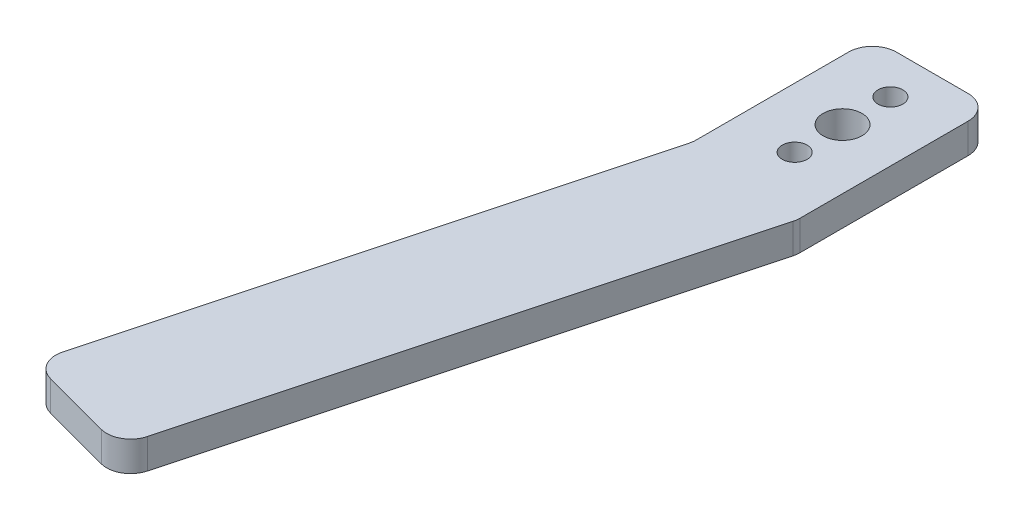
ISO-10303-21;
HEADER;
FILE_DESCRIPTION(('STEP AP214'),'2;1');
FILE_NAME('part.step','',(''),(''),'','','');
FILE_SCHEMA(('AUTOMOTIVE_DESIGN { 1 0 10303 214 1 1 1 1 }'));
ENDSEC;
DATA;
#1=APPLICATION_CONTEXT('core data for automotive mechanical design processes');
#2=APPLICATION_PROTOCOL_DEFINITION('international standard','automotive_design',2000,#1);
#3=PRODUCT_CONTEXT('',#1,'mechanical');
#4=PRODUCT('Part','Part','',(#3));
#5=PRODUCT_RELATED_PRODUCT_CATEGORY('part','',(#4));
#6=PRODUCT_DEFINITION_FORMATION('','',#4);
#7=PRODUCT_DEFINITION_CONTEXT('part definition',#1,'design');
#8=PRODUCT_DEFINITION('design','',#6,#7);
#9=PRODUCT_DEFINITION_SHAPE('','',#8);
#10=(LENGTH_UNIT() NAMED_UNIT(*) SI_UNIT(.MILLI.,.METRE.));
#11=(NAMED_UNIT(*) PLANE_ANGLE_UNIT() SI_UNIT($,.RADIAN.));
#12=(NAMED_UNIT(*) SI_UNIT($,.STERADIAN.) SOLID_ANGLE_UNIT());
#13=UNCERTAINTY_MEASURE_WITH_UNIT(LENGTH_MEASURE(1.E-05),#10,'distance_accuracy_value','');
#14=(GEOMETRIC_REPRESENTATION_CONTEXT(3) GLOBAL_UNCERTAINTY_ASSIGNED_CONTEXT((#13)) GLOBAL_UNIT_ASSIGNED_CONTEXT((#10,
#11,#12)) REPRESENTATION_CONTEXT('',''));
#15=CARTESIAN_POINT('',(0.,0.,0.));
#16=DIRECTION('',(0.,0.,1.));
#17=DIRECTION('',(1.,0.,0.));
#18=AXIS2_PLACEMENT_3D('',#15,#16,#17);
#19=CARTESIAN_POINT('',(0.,5.,0.));
#20=DIRECTION('',(0.,1.,0.));
#21=DIRECTION('',(0.,0.,1.));
#22=AXIS2_PLACEMENT_3D('',#19,#20,#21);
#23=PLANE('',#22);
#24=CARTESIAN_POINT('',(-49.15,5.,8.));
#25=DIRECTION('',(0.,1.,0.));
#26=DIRECTION('',(0.,0.,1.));
#27=AXIS2_PLACEMENT_3D('',#24,#25,#26);
#28=CIRCLE('',#27,2.075);
#29=CARTESIAN_POINT('',(-49.15,5.,10.075));
#30=VERTEX_POINT('',#29);
#31=EDGE_CURVE('E255',#30,#30,#28,.F.);
#32=ORIENTED_EDGE('',*,*,#31,.T.);
#33=EDGE_LOOP('',(#32));
#34=FACE_BOUND('',#33,.T.);
#35=CARTESIAN_POINT('',(-49.15,5.,-8.));
#36=DIRECTION('',(0.,1.,0.));
#37=DIRECTION('',(0.,0.,1.));
#38=AXIS2_PLACEMENT_3D('',#35,#36,#37);
#39=CIRCLE('',#38,2.075);
#40=CARTESIAN_POINT('',(-49.15,5.,-5.925));
#41=VERTEX_POINT('',#40);
#42=EDGE_CURVE('E247',#41,#41,#39,.T.);
#43=ORIENTED_EDGE('',*,*,#42,.F.);
#44=EDGE_LOOP('',(#43));
#45=FACE_BOUND('',#44,.T.);
#46=DIRECTION('',(-1.,0.,0.));
#47=VECTOR('',#46,1.);
#48=CARTESIAN_POINT('',(-59.15,5.,-15.));
#49=LINE('',#48,#47);
#50=CARTESIAN_POINT('',(-43.15,5.,-15.));
#51=VERTEX_POINT('',#50);
#52=CARTESIAN_POINT('',(-55.15,5.,-15.));
#53=VERTEX_POINT('',#52);
#54=EDGE_CURVE('E236',#51,#53,#49,.T.);
#55=ORIENTED_EDGE('',*,*,#54,.T.);
#56=CARTESIAN_POINT('',(-55.15,5.,-11.));
#57=DIRECTION('',(0.,1.,0.));
#58=DIRECTION('',(0.,0.,1.));
#59=AXIS2_PLACEMENT_3D('',#56,#57,#58);
#60=CIRCLE('',#59,4.);
#61=CARTESIAN_POINT('',(-59.15,5.,-11.));
#62=VERTEX_POINT('',#61);
#63=EDGE_CURVE('E186',#53,#62,#60,.T.);
#64=ORIENTED_EDGE('',*,*,#63,.T.);
#65=DIRECTION('',(0.,0.,1.));
#66=VECTOR('',#65,1.);
#67=CARTESIAN_POINT('',(-59.15,5.,-15.));
#68=LINE('',#67,#66);
#69=CARTESIAN_POINT('',(-59.15,5.,14.4733900096504));
#70=VERTEX_POINT('',#69);
#71=EDGE_CURVE('E235',#62,#70,#68,.T.);
#72=ORIENTED_EDGE('',*,*,#71,.T.);
#73=CARTESIAN_POINT('',(-63.15,5.,14.4733900096504));
#74=DIRECTION('',(0.,1.,0.));
#75=DIRECTION('',(0.,0.,1.));
#76=AXIS2_PLACEMENT_3D('',#73,#74,#75);
#77=CIRCLE('',#76,4.);
#78=CARTESIAN_POINT('',(-59.2862966948437,5.,15.5086661900605));
#79=VERTEX_POINT('',#78);
#80=EDGE_CURVE('E11',#70,#79,#77,.F.);
#81=ORIENTED_EDGE('',*,*,#80,.T.);
#82=DIRECTION('',(-0.258819045102521,0.,0.965925826289068));
#83=VECTOR('',#82,1.);
#84=CARTESIAN_POINT('',(-59.15,5.,15.));
#85=LINE('',#84,#83);
#86=CARTESIAN_POINT('',(-81.4084378788168,5.,98.0696210608599));
#87=VERTEX_POINT('',#86);
#88=EDGE_CURVE('E140',#79,#87,#85,.T.);
#89=ORIENTED_EDGE('',*,*,#88,.T.);
#90=CARTESIAN_POINT('',(-77.5447345736605,5.,99.10489724127));
#91=DIRECTION('',(0.,1.,0.));
#92=DIRECTION('',(0.,0.,1.));
#93=AXIS2_PLACEMENT_3D('',#90,#91,#92);
#94=CIRCLE('',#93,4.);
#95=CARTESIAN_POINT('',(-78.5800107540706,5.,102.968600546426));
#96=VERTEX_POINT('',#95);
#97=EDGE_CURVE('E180',#87,#96,#94,.T.);
#98=ORIENTED_EDGE('',*,*,#97,.T.);
#99=DIRECTION('',(0.965925826289068,0.,0.25881904510252));
#100=VECTOR('',#99,1.);
#101=CARTESIAN_POINT('',(-82.4437140592269,5.,101.933324366016));
#102=LINE('',#101,#100);
#103=CARTESIAN_POINT('',(-66.9889008386019,5.,106.074429087656));
#104=VERTEX_POINT('',#103);
#105=EDGE_CURVE('E205',#96,#104,#102,.T.);
#106=ORIENTED_EDGE('',*,*,#105,.T.);
#107=CARTESIAN_POINT('',(-65.9536246581918,5.,102.2107257825));
#108=DIRECTION('',(0.,1.,0.));
#109=DIRECTION('',(0.,0.,1.));
#110=AXIS2_PLACEMENT_3D('',#107,#108,#109);
#111=CIRCLE('',#110,4.);
#112=CARTESIAN_POINT('',(-62.0899213530355,5.,103.24600196291));
#113=VERTEX_POINT('',#112);
#114=EDGE_CURVE('E55',#104,#113,#111,.T.);
#115=ORIENTED_EDGE('',*,*,#114,.T.);
#116=DIRECTION('',(0.258819045102521,0.,-0.965925826289068));
#117=VECTOR('',#116,1.);
#118=CARTESIAN_POINT('',(-39.8314834742186,5.,20.1763809020504));
#119=LINE('',#118,#117);
#120=CARTESIAN_POINT('',(-39.2862966948437,5.,18.1417161418084));
#121=VERTEX_POINT('',#120);
#122=EDGE_CURVE('E160',#113,#121,#119,.T.);
#123=ORIENTED_EDGE('',*,*,#122,.T.);
#124=CARTESIAN_POINT('',(-43.15,5.,17.1064399613983));
#125=DIRECTION('',(0.,1.,0.));
#126=DIRECTION('',(0.,0.,1.));
#127=AXIS2_PLACEMENT_3D('',#124,#125,#126);
#128=CIRCLE('',#127,4.);
#129=CARTESIAN_POINT('',(-39.15,5.,17.1064399613983));
#130=VERTEX_POINT('',#129);
#131=EDGE_CURVE('E182',#121,#130,#128,.T.);
#132=ORIENTED_EDGE('',*,*,#131,.T.);
#133=DIRECTION('',(0.,0.,-1.));
#134=VECTOR('',#133,1.);
#135=CARTESIAN_POINT('',(-39.15,5.,15.));
#136=LINE('',#135,#134);
#137=CARTESIAN_POINT('',(-39.1500000000001,5.,-11.));
#138=VERTEX_POINT('',#137);
#139=EDGE_CURVE('E159',#130,#138,#136,.T.);
#140=ORIENTED_EDGE('',*,*,#139,.T.);
#141=CARTESIAN_POINT('',(-43.15,5.,-11.));
#142=DIRECTION('',(0.,1.,0.));
#143=DIRECTION('',(0.,0.,1.));
#144=AXIS2_PLACEMENT_3D('',#141,#142,#143);
#145=CIRCLE('',#144,4.);
#146=EDGE_CURVE('E184',#138,#51,#145,.T.);
#147=ORIENTED_EDGE('',*,*,#146,.T.);
#148=EDGE_LOOP('',(#55,#64,#72,#81,#89,#98,#106,#115,#123,#132,#140,#147));
#149=FACE_BOUND('',#148,.T.);
#150=CARTESIAN_POINT('',(-49.15,5.,0.));
#151=DIRECTION('',(0.,1.,0.));
#152=DIRECTION('',(0.,0.,1.));
#153=AXIS2_PLACEMENT_3D('',#150,#151,#152);
#154=CIRCLE('',#153,3.25);
#155=CARTESIAN_POINT('',(-49.15,5.,3.25));
#156=VERTEX_POINT('',#155);
#157=EDGE_CURVE('E219',#156,#156,#154,.T.);
#158=ORIENTED_EDGE('',*,*,#157,.F.);
#159=EDGE_LOOP('',(#158));
#160=FACE_BOUND('',#159,.T.);
#161=ADVANCED_FACE('F33',(#34,#45,#149,#160),#23,.T.);
#162=CARTESIAN_POINT('',(0.,0.,0.));
#163=DIRECTION('',(0.,1.,0.));
#164=DIRECTION('',(0.,0.,1.));
#165=AXIS2_PLACEMENT_3D('',#162,#163,#164);
#166=PLANE('',#165);
#167=CARTESIAN_POINT('',(-49.15,0.,8.));
#168=DIRECTION('',(0.,-1.,0.));
#169=DIRECTION('',(0.,0.,-1.));
#170=AXIS2_PLACEMENT_3D('',#167,#168,#169);
#171=CIRCLE('',#170,2.075);
#172=CARTESIAN_POINT('',(-49.15,0.,5.925));
#173=VERTEX_POINT('',#172);
#174=EDGE_CURVE('E258',#173,#173,#171,.T.);
#175=ORIENTED_EDGE('',*,*,#174,.F.);
#176=EDGE_LOOP('',(#175));
#177=FACE_BOUND('',#176,.T.);
#178=CARTESIAN_POINT('',(-49.15,0.,-8.));
#179=DIRECTION('',(0.,1.,0.));
#180=DIRECTION('',(0.,0.,1.));
#181=AXIS2_PLACEMENT_3D('',#178,#179,#180);
#182=CIRCLE('',#181,2.075);
#183=CARTESIAN_POINT('',(-49.15,0.,-5.925));
#184=VERTEX_POINT('',#183);
#185=EDGE_CURVE('E252',#184,#184,#182,.T.);
#186=ORIENTED_EDGE('',*,*,#185,.T.);
#187=EDGE_LOOP('',(#186));
#188=FACE_BOUND('',#187,.T.);
#189=DIRECTION('',(0.,0.,1.));
#190=VECTOR('',#189,1.);
#191=CARTESIAN_POINT('',(-59.15,0.,-15.));
#192=LINE('',#191,#190);
#193=CARTESIAN_POINT('',(-59.15,0.,-11.));
#194=VERTEX_POINT('',#193);
#195=CARTESIAN_POINT('',(-59.15,0.,14.4733900096504));
#196=VERTEX_POINT('',#195);
#197=EDGE_CURVE('E149',#194,#196,#192,.T.);
#198=ORIENTED_EDGE('',*,*,#197,.F.);
#199=CARTESIAN_POINT('',(-55.15,0.,-11.));
#200=DIRECTION('',(0.,1.,0.));
#201=DIRECTION('',(0.,0.,1.));
#202=AXIS2_PLACEMENT_3D('',#199,#200,#201);
#203=CIRCLE('',#202,4.);
#204=CARTESIAN_POINT('',(-55.15,0.,-15.));
#205=VERTEX_POINT('',#204);
#206=EDGE_CURVE('E172',#194,#205,#203,.F.);
#207=ORIENTED_EDGE('',*,*,#206,.T.);
#208=DIRECTION('',(-1.,0.,0.));
#209=VECTOR('',#208,1.);
#210=CARTESIAN_POINT('',(-59.15,0.,-15.));
#211=LINE('',#210,#209);
#212=CARTESIAN_POINT('',(-43.15,0.,-15.));
#213=VERTEX_POINT('',#212);
#214=EDGE_CURVE('E154',#213,#205,#211,.T.);
#215=ORIENTED_EDGE('',*,*,#214,.F.);
#216=CARTESIAN_POINT('',(-43.15,0.,-11.));
#217=DIRECTION('',(0.,1.,0.));
#218=DIRECTION('',(0.,0.,1.));
#219=AXIS2_PLACEMENT_3D('',#216,#217,#218);
#220=CIRCLE('',#219,4.);
#221=CARTESIAN_POINT('',(-39.15,0.,-11.));
#222=VERTEX_POINT('',#221);
#223=EDGE_CURVE('E170',#213,#222,#220,.F.);
#224=ORIENTED_EDGE('',*,*,#223,.T.);
#225=DIRECTION('',(0.,0.,-1.));
#226=VECTOR('',#225,1.);
#227=CARTESIAN_POINT('',(-39.15,0.,-15.));
#228=LINE('',#227,#226);
#229=CARTESIAN_POINT('',(-39.15,0.,17.1064399613983));
#230=VERTEX_POINT('',#229);
#231=EDGE_CURVE('E217',#230,#222,#228,.T.);
#232=ORIENTED_EDGE('',*,*,#231,.F.);
#233=CARTESIAN_POINT('',(-43.15,0.,17.1064399613983));
#234=DIRECTION('',(0.,1.,0.));
#235=DIRECTION('',(0.,0.,1.));
#236=AXIS2_PLACEMENT_3D('',#233,#234,#235);
#237=CIRCLE('',#236,4.);
#238=CARTESIAN_POINT('',(-39.2862966948437,0.,18.1417161418084));
#239=VERTEX_POINT('',#238);
#240=EDGE_CURVE('E168',#230,#239,#237,.F.);
#241=ORIENTED_EDGE('',*,*,#240,.T.);
#242=DIRECTION('',(0.258819045102522,0.,-0.965925826289068));
#243=VECTOR('',#242,1.);
#244=CARTESIAN_POINT('',(-39.8314834742186,0.,20.1763809020504));
#245=LINE('',#244,#243);
#246=CARTESIAN_POINT('',(-62.0899213530355,0.,103.24600196291));
#247=VERTEX_POINT('',#246);
#248=EDGE_CURVE('E152',#247,#239,#245,.T.);
#249=ORIENTED_EDGE('',*,*,#248,.F.);
#250=CARTESIAN_POINT('',(-65.9536246581918,0.,102.2107257825));
#251=DIRECTION('',(0.,1.,0.));
#252=DIRECTION('',(0.,0.,1.));
#253=AXIS2_PLACEMENT_3D('',#250,#251,#252);
#254=CIRCLE('',#253,4.);
#255=CARTESIAN_POINT('',(-66.9889008386019,0.,106.074429087656));
#256=VERTEX_POINT('',#255);
#257=EDGE_CURVE('E165',#247,#256,#254,.F.);
#258=ORIENTED_EDGE('',*,*,#257,.T.);
#259=DIRECTION('',(0.965925826289068,0.,0.25881904510252));
#260=VECTOR('',#259,1.);
#261=CARTESIAN_POINT('',(-82.4437140592269,0.,101.933324366016));
#262=LINE('',#261,#260);
#263=CARTESIAN_POINT('',(-78.5800107540706,0.,102.968600546426));
#264=VERTEX_POINT('',#263);
#265=EDGE_CURVE('E148',#264,#256,#262,.T.);
#266=ORIENTED_EDGE('',*,*,#265,.F.);
#267=CARTESIAN_POINT('',(-77.5447345736605,0.,99.10489724127));
#268=DIRECTION('',(0.,1.,0.));
#269=DIRECTION('',(0.,0.,1.));
#270=AXIS2_PLACEMENT_3D('',#267,#268,#269);
#271=CIRCLE('',#270,4.);
#272=CARTESIAN_POINT('',(-81.4084378788168,0.,98.0696210608599));
#273=VERTEX_POINT('',#272);
#274=EDGE_CURVE('E147',#264,#273,#271,.F.);
#275=ORIENTED_EDGE('',*,*,#274,.T.);
#276=DIRECTION('',(-0.258819045102521,0.,0.965925826289068));
#277=VECTOR('',#276,1.);
#278=CARTESIAN_POINT('',(-59.15,0.,15.));
#279=LINE('',#278,#277);
#280=CARTESIAN_POINT('',(-59.2862966948437,0.,15.5086661900605));
#281=VERTEX_POINT('',#280);
#282=EDGE_CURVE('E137',#281,#273,#279,.T.);
#283=ORIENTED_EDGE('',*,*,#282,.F.);
#284=CARTESIAN_POINT('',(-63.15,0.,14.4733900096504));
#285=DIRECTION('',(0.,1.,0.));
#286=DIRECTION('',(0.,0.,1.));
#287=AXIS2_PLACEMENT_3D('',#284,#285,#286);
#288=CIRCLE('',#287,4.);
#289=EDGE_CURVE('E41',#281,#196,#288,.T.);
#290=ORIENTED_EDGE('',*,*,#289,.T.);
#291=EDGE_LOOP('',(#198,#207,#215,#224,#232,#241,#249,#258,#266,#275,#283,#290));
#292=FACE_BOUND('',#291,.T.);
#293=CARTESIAN_POINT('',(-49.15,0.,0.));
#294=DIRECTION('',(0.,1.,0.));
#295=DIRECTION('',(0.,0.,1.));
#296=AXIS2_PLACEMENT_3D('',#293,#294,#295);
#297=CIRCLE('',#296,3.25);
#298=CARTESIAN_POINT('',(-49.15,0.,3.25));
#299=VERTEX_POINT('',#298);
#300=EDGE_CURVE('E244',#299,#299,#297,.T.);
#301=ORIENTED_EDGE('',*,*,#300,.T.);
#302=EDGE_LOOP('',(#301));
#303=FACE_BOUND('',#302,.T.);
#304=ADVANCED_FACE('F144',(#177,#188,#292,#303),#166,.F.);
#305=CARTESIAN_POINT('',(-39.15,5.,-15.));
#306=DIRECTION('',(-1.,0.,0.));
#307=DIRECTION('',(0.,0.,1.));
#308=AXIS2_PLACEMENT_3D('',#305,#306,#307);
#309=PLANE('',#308);
#310=ORIENTED_EDGE('',*,*,#231,.T.);
#311=DIRECTION('',(0.,-1.,0.));
#312=VECTOR('',#311,1.);
#313=CARTESIAN_POINT('',(-39.15,5.,-11.));
#314=LINE('',#313,#312);
#315=EDGE_CURVE('E191',#222,#138,#314,.F.);
#316=ORIENTED_EDGE('',*,*,#315,.T.);
#317=ORIENTED_EDGE('',*,*,#139,.F.);
#318=DIRECTION('',(0.,-1.,0.));
#319=VECTOR('',#318,1.);
#320=CARTESIAN_POINT('',(-39.15,5.,17.1064399613983));
#321=LINE('',#320,#319);
#322=EDGE_CURVE('E188',#130,#230,#321,.T.);
#323=ORIENTED_EDGE('',*,*,#322,.T.);
#324=EDGE_LOOP('',(#310,#316,#317,#323));
#325=FACE_BOUND('',#324,.T.);
#326=ADVANCED_FACE('F266',(#325),#309,.F.);
#327=CARTESIAN_POINT('',(-59.15,5.,-15.));
#328=DIRECTION('',(0.,0.,1.));
#329=DIRECTION('',(1.,0.,0.));
#330=AXIS2_PLACEMENT_3D('',#327,#328,#329);
#331=PLANE('',#330);
#332=ORIENTED_EDGE('',*,*,#214,.T.);
#333=DIRECTION('',(0.,-1.,0.));
#334=VECTOR('',#333,1.);
#335=CARTESIAN_POINT('',(-55.15,5.,-15.));
#336=LINE('',#335,#334);
#337=EDGE_CURVE('E177',#205,#53,#336,.F.);
#338=ORIENTED_EDGE('',*,*,#337,.T.);
#339=ORIENTED_EDGE('',*,*,#54,.F.);
#340=DIRECTION('',(0.,-1.,0.));
#341=VECTOR('',#340,1.);
#342=CARTESIAN_POINT('',(-43.15,5.,-15.));
#343=LINE('',#342,#341);
#344=EDGE_CURVE('E174',#51,#213,#343,.T.);
#345=ORIENTED_EDGE('',*,*,#344,.T.);
#346=EDGE_LOOP('',(#332,#338,#339,#345));
#347=FACE_BOUND('',#346,.T.);
#348=ADVANCED_FACE('F224',(#347),#331,.F.);
#349=CARTESIAN_POINT('',(-59.15,5.,-15.));
#350=DIRECTION('',(1.,0.,0.));
#351=DIRECTION('',(0.,0.,-1.));
#352=AXIS2_PLACEMENT_3D('',#349,#350,#351);
#353=PLANE('',#352);
#354=ORIENTED_EDGE('',*,*,#197,.T.);
#355=DIRECTION('',(0.,-1.,0.));
#356=VECTOR('',#355,1.);
#357=CARTESIAN_POINT('',(-59.15,5.,14.4733900096504));
#358=LINE('',#357,#356);
#359=EDGE_CURVE('E127',#196,#70,#358,.F.);
#360=ORIENTED_EDGE('',*,*,#359,.T.);
#361=ORIENTED_EDGE('',*,*,#71,.F.);
#362=DIRECTION('',(0.,-1.,0.));
#363=VECTOR('',#362,1.);
#364=CARTESIAN_POINT('',(-59.15,5.,-11.));
#365=LINE('',#364,#363);
#366=EDGE_CURVE('E141',#62,#194,#365,.T.);
#367=ORIENTED_EDGE('',*,*,#366,.T.);
#368=EDGE_LOOP('',(#354,#360,#361,#367));
#369=FACE_BOUND('',#368,.T.);
#370=ADVANCED_FACE('F238',(#369),#353,.F.);
#371=CARTESIAN_POINT('',(-59.15,5.,15.));
#372=DIRECTION('',(0.965925826289068,0.,0.258819045102521));
#373=DIRECTION('',(0.258819045102521,0.,-0.965925826289068));
#374=AXIS2_PLACEMENT_3D('',#371,#372,#373);
#375=PLANE('',#374);
#376=ORIENTED_EDGE('',*,*,#88,.F.);
#377=DIRECTION('',(0.,-1.,0.));
#378=VECTOR('',#377,1.);
#379=CARTESIAN_POINT('',(-59.2862966948437,0.,15.5086661900605));
#380=LINE('',#379,#378);
#381=EDGE_CURVE('E126',#79,#281,#380,.T.);
#382=ORIENTED_EDGE('',*,*,#381,.T.);
#383=ORIENTED_EDGE('',*,*,#282,.T.);
#384=DIRECTION('',(0.,-1.,0.));
#385=VECTOR('',#384,1.);
#386=CARTESIAN_POINT('',(-81.4084378788168,5.,98.0696210608599));
#387=LINE('',#386,#385);
#388=EDGE_CURVE('E142',#273,#87,#387,.F.);
#389=ORIENTED_EDGE('',*,*,#388,.T.);
#390=EDGE_LOOP('',(#376,#382,#383,#389));
#391=FACE_BOUND('',#390,.T.);
#392=ADVANCED_FACE('F136',(#391),#375,.F.);
#393=CARTESIAN_POINT('',(-82.4437140592269,5.,101.933324366016));
#394=DIRECTION('',(0.25881904510252,0.,-0.965925826289069));
#395=DIRECTION('',(-0.965925826289069,0.,-0.25881904510252));
#396=AXIS2_PLACEMENT_3D('',#393,#394,#395);
#397=PLANE('',#396);
#398=ORIENTED_EDGE('',*,*,#105,.F.);
#399=DIRECTION('',(0.,-1.,0.));
#400=VECTOR('',#399,1.);
#401=CARTESIAN_POINT('',(-78.5800107540706,5.,102.968600546426));
#402=LINE('',#401,#400);
#403=EDGE_CURVE('E132',#96,#264,#402,.T.);
#404=ORIENTED_EDGE('',*,*,#403,.T.);
#405=ORIENTED_EDGE('',*,*,#265,.T.);
#406=DIRECTION('',(0.,-1.,0.));
#407=VECTOR('',#406,1.);
#408=CARTESIAN_POINT('',(-66.9889008386019,5.,106.074429087656));
#409=LINE('',#408,#407);
#410=EDGE_CURVE('E197',#256,#104,#409,.F.);
#411=ORIENTED_EDGE('',*,*,#410,.T.);
#412=EDGE_LOOP('',(#398,#404,#405,#411));
#413=FACE_BOUND('',#412,.T.);
#414=ADVANCED_FACE('F203',(#413),#397,.F.);
#415=CARTESIAN_POINT('',(-39.8314834742186,5.,20.1763809020504));
#416=DIRECTION('',(-0.965925826289068,0.,-0.258819045102522));
#417=DIRECTION('',(-0.258819045102522,0.,0.965925826289068));
#418=AXIS2_PLACEMENT_3D('',#415,#416,#417);
#419=PLANE('',#418);
#420=ORIENTED_EDGE('',*,*,#248,.T.);
#421=DIRECTION('',(0.,-1.,0.));
#422=VECTOR('',#421,1.);
#423=CARTESIAN_POINT('',(-39.2862966948437,5.,18.1417161418084));
#424=LINE('',#423,#422);
#425=EDGE_CURVE('E48',#239,#121,#424,.F.);
#426=ORIENTED_EDGE('',*,*,#425,.T.);
#427=ORIENTED_EDGE('',*,*,#122,.F.);
#428=DIRECTION('',(0.,-1.,0.));
#429=VECTOR('',#428,1.);
#430=CARTESIAN_POINT('',(-62.0899213530355,5.,103.24600196291));
#431=LINE('',#430,#429);
#432=EDGE_CURVE('E193',#113,#247,#431,.T.);
#433=ORIENTED_EDGE('',*,*,#432,.T.);
#434=EDGE_LOOP('',(#420,#426,#427,#433));
#435=FACE_BOUND('',#434,.T.);
#436=ADVANCED_FACE('F211',(#435),#419,.F.);
#437=CARTESIAN_POINT('',(-49.15,5.,0.));
#438=DIRECTION('',(0.,-1.,0.));
#439=DIRECTION('',(0.,0.,-1.));
#440=AXIS2_PLACEMENT_3D('',#437,#438,#439);
#441=CYLINDRICAL_SURFACE('',#440,3.25);
#442=ORIENTED_EDGE('',*,*,#157,.T.);
#443=EDGE_LOOP('',(#442));
#444=FACE_BOUND('',#443,.T.);
#445=ORIENTED_EDGE('',*,*,#300,.F.);
#446=EDGE_LOOP('',(#445));
#447=FACE_BOUND('',#446,.T.);
#448=ADVANCED_FACE('F272',(#444,#447),#441,.F.);
#449=CARTESIAN_POINT('',(-49.15,0.,-8.));
#450=DIRECTION('',(0.,1.,0.));
#451=DIRECTION('',(0.,0.,1.));
#452=AXIS2_PLACEMENT_3D('',#449,#450,#451);
#453=CYLINDRICAL_SURFACE('',#452,2.075);
#454=ORIENTED_EDGE('',*,*,#42,.T.);
#455=EDGE_LOOP('',(#454));
#456=FACE_BOUND('',#455,.T.);
#457=ORIENTED_EDGE('',*,*,#185,.F.);
#458=EDGE_LOOP('',(#457));
#459=FACE_BOUND('',#458,.T.);
#460=ADVANCED_FACE('F270',(#456,#459),#453,.F.);
#461=CARTESIAN_POINT('',(-49.15,0.,8.));
#462=DIRECTION('',(0.,1.,0.));
#463=DIRECTION('',(0.,0.,1.));
#464=AXIS2_PLACEMENT_3D('',#461,#462,#463);
#465=CYLINDRICAL_SURFACE('',#464,2.075);
#466=ORIENTED_EDGE('',*,*,#31,.F.);
#467=EDGE_LOOP('',(#466));
#468=FACE_BOUND('',#467,.T.);
#469=ORIENTED_EDGE('',*,*,#174,.T.);
#470=EDGE_LOOP('',(#469));
#471=FACE_BOUND('',#470,.T.);
#472=ADVANCED_FACE('F262',(#468,#471),#465,.F.);
#473=CARTESIAN_POINT('',(-63.15,5.,14.4733900096504));
#474=DIRECTION('',(0.,1.,0.));
#475=DIRECTION('',(0.,0.,1.));
#476=AXIS2_PLACEMENT_3D('',#473,#474,#475);
#477=CYLINDRICAL_SURFACE('',#476,4.);
#478=ORIENTED_EDGE('',*,*,#80,.F.);
#479=ORIENTED_EDGE('',*,*,#359,.F.);
#480=ORIENTED_EDGE('',*,*,#289,.F.);
#481=ORIENTED_EDGE('',*,*,#381,.F.);
#482=EDGE_LOOP('',(#478,#479,#480,#481));
#483=FACE_BOUND('',#482,.T.);
#484=ADVANCED_FACE('F125',(#483),#477,.F.);
#485=CARTESIAN_POINT('',(-55.15,5.,-11.));
#486=DIRECTION('',(0.,-1.,0.));
#487=DIRECTION('',(0.,0.,-1.));
#488=AXIS2_PLACEMENT_3D('',#485,#486,#487);
#489=CYLINDRICAL_SURFACE('',#488,4.);
#490=ORIENTED_EDGE('',*,*,#63,.F.);
#491=ORIENTED_EDGE('',*,*,#337,.F.);
#492=ORIENTED_EDGE('',*,*,#206,.F.);
#493=ORIENTED_EDGE('',*,*,#366,.F.);
#494=EDGE_LOOP('',(#490,#491,#492,#493));
#495=FACE_BOUND('',#494,.T.);
#496=ADVANCED_FACE('F230',(#495),#489,.T.);
#497=CARTESIAN_POINT('',(-43.15,5.,-11.));
#498=DIRECTION('',(0.,-1.,0.));
#499=DIRECTION('',(0.,0.,-1.));
#500=AXIS2_PLACEMENT_3D('',#497,#498,#499);
#501=CYLINDRICAL_SURFACE('',#500,4.);
#502=ORIENTED_EDGE('',*,*,#146,.F.);
#503=ORIENTED_EDGE('',*,*,#315,.F.);
#504=ORIENTED_EDGE('',*,*,#223,.F.);
#505=ORIENTED_EDGE('',*,*,#344,.F.);
#506=EDGE_LOOP('',(#502,#503,#504,#505));
#507=FACE_BOUND('',#506,.T.);
#508=ADVANCED_FACE('F307',(#507),#501,.T.);
#509=CARTESIAN_POINT('',(-43.15,5.,17.1064399613983));
#510=DIRECTION('',(0.,-1.,0.));
#511=DIRECTION('',(0.,0.,-1.));
#512=AXIS2_PLACEMENT_3D('',#509,#510,#511);
#513=CYLINDRICAL_SURFACE('',#512,4.);
#514=ORIENTED_EDGE('',*,*,#131,.F.);
#515=ORIENTED_EDGE('',*,*,#425,.F.);
#516=ORIENTED_EDGE('',*,*,#240,.F.);
#517=ORIENTED_EDGE('',*,*,#322,.F.);
#518=EDGE_LOOP('',(#514,#515,#516,#517));
#519=FACE_BOUND('',#518,.T.);
#520=ADVANCED_FACE('F310',(#519),#513,.T.);
#521=CARTESIAN_POINT('',(-77.5447345736605,5.,99.10489724127));
#522=DIRECTION('',(0.,-1.,0.));
#523=DIRECTION('',(0.,0.,-1.));
#524=AXIS2_PLACEMENT_3D('',#521,#522,#523);
#525=CYLINDRICAL_SURFACE('',#524,4.);
#526=ORIENTED_EDGE('',*,*,#97,.F.);
#527=ORIENTED_EDGE('',*,*,#388,.F.);
#528=ORIENTED_EDGE('',*,*,#274,.F.);
#529=ORIENTED_EDGE('',*,*,#403,.F.);
#530=EDGE_LOOP('',(#526,#527,#528,#529));
#531=FACE_BOUND('',#530,.T.);
#532=ADVANCED_FACE('F313',(#531),#525,.T.);
#533=CARTESIAN_POINT('',(-65.9536246581918,5.,102.2107257825));
#534=DIRECTION('',(0.,-1.,0.));
#535=DIRECTION('',(0.,0.,-1.));
#536=AXIS2_PLACEMENT_3D('',#533,#534,#535);
#537=CYLINDRICAL_SURFACE('',#536,4.);
#538=ORIENTED_EDGE('',*,*,#114,.F.);
#539=ORIENTED_EDGE('',*,*,#410,.F.);
#540=ORIENTED_EDGE('',*,*,#257,.F.);
#541=ORIENTED_EDGE('',*,*,#432,.F.);
#542=EDGE_LOOP('',(#538,#539,#540,#541));
#543=FACE_BOUND('',#542,.T.);
#544=ADVANCED_FACE('F35',(#543),#537,.T.);
#545=CLOSED_SHELL('',(#161,#304,#326,#348,#370,#392,#414,#436,#448,#460,#472,#484,#496,#508,
#520,#532,#544));
#546=MANIFOLD_SOLID_BREP('B2',#545);
#547=ADVANCED_BREP_SHAPE_REPRESENTATION('',(#18,#546),#14);
#548=SHAPE_DEFINITION_REPRESENTATION(#9,#547);
ENDSEC;
END-ISO-10303-21;
